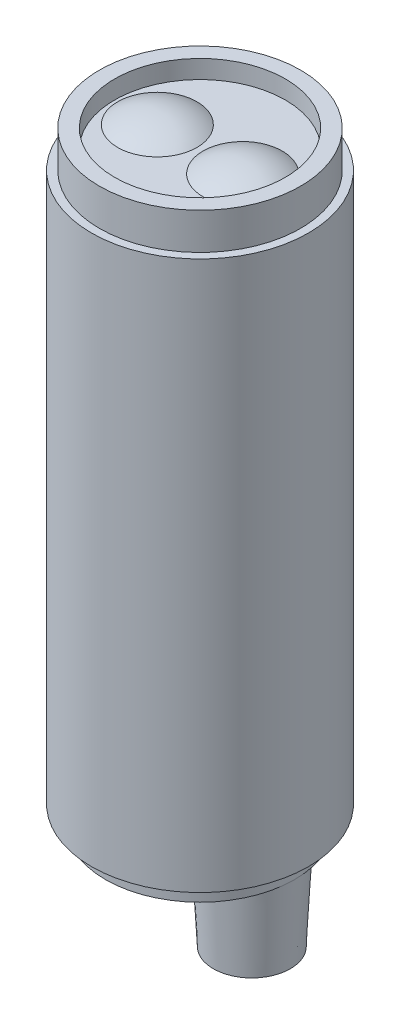
ISO-10303-21;
HEADER;
FILE_DESCRIPTION(('STEP AP214'),'2;1');
FILE_NAME('part.step','',(''),(''),'','','');
FILE_SCHEMA(('AUTOMOTIVE_DESIGN { 1 0 10303 214 1 1 1 1 }'));
ENDSEC;
DATA;
#1=APPLICATION_CONTEXT('core data for automotive mechanical design processes');
#2=APPLICATION_PROTOCOL_DEFINITION('international standard','automotive_design',2000,#1);
#3=PRODUCT_CONTEXT('',#1,'mechanical');
#4=PRODUCT('Part','Part','',(#3));
#5=PRODUCT_RELATED_PRODUCT_CATEGORY('part','',(#4));
#6=PRODUCT_DEFINITION_FORMATION('','',#4);
#7=PRODUCT_DEFINITION_CONTEXT('part definition',#1,'design');
#8=PRODUCT_DEFINITION('design','',#6,#7);
#9=PRODUCT_DEFINITION_SHAPE('','',#8);
#10=(LENGTH_UNIT() NAMED_UNIT(*) SI_UNIT(.MILLI.,.METRE.));
#11=(NAMED_UNIT(*) PLANE_ANGLE_UNIT() SI_UNIT($,.RADIAN.));
#12=(NAMED_UNIT(*) SI_UNIT($,.STERADIAN.) SOLID_ANGLE_UNIT());
#13=UNCERTAINTY_MEASURE_WITH_UNIT(LENGTH_MEASURE(1.E-05),#10,'distance_accuracy_value','');
#14=(GEOMETRIC_REPRESENTATION_CONTEXT(3) GLOBAL_UNCERTAINTY_ASSIGNED_CONTEXT((#13)) GLOBAL_UNIT_ASSIGNED_CONTEXT((#10,
#11,#12)) REPRESENTATION_CONTEXT('',''));
#15=CARTESIAN_POINT('',(0.,0.,0.));
#16=DIRECTION('',(0.,0.,1.));
#17=DIRECTION('',(1.,0.,0.));
#18=AXIS2_PLACEMENT_3D('',#15,#16,#17);
#19=CARTESIAN_POINT('',(0.,-1.5,0.));
#20=DIRECTION('',(0.,1.,0.));
#21=DIRECTION('',(0.,0.,1.));
#22=AXIS2_PLACEMENT_3D('',#19,#20,#21);
#23=CYLINDRICAL_SURFACE('',#22,7.75);
#24=CARTESIAN_POINT('',(0.,-1.5,0.));
#25=DIRECTION('',(0.,-1.,0.));
#26=DIRECTION('',(0.,0.,-1.));
#27=AXIS2_PLACEMENT_3D('',#24,#25,#26);
#28=CIRCLE('',#27,7.75);
#29=CARTESIAN_POINT('',(7.75,-1.5,0.));
#30=VERTEX_POINT('',#29);
#31=EDGE_CURVE('E12',#30,#30,#28,.T.);
#32=ORIENTED_EDGE('',*,*,#31,.F.);
#33=EDGE_LOOP('',(#32));
#34=FACE_BOUND('',#33,.T.);
#35=CARTESIAN_POINT('',(0.,0.,0.));
#36=DIRECTION('',(0.,-1.,0.));
#37=DIRECTION('',(0.,0.,-1.));
#38=AXIS2_PLACEMENT_3D('',#35,#36,#37);
#39=CIRCLE('',#38,7.75);
#40=CARTESIAN_POINT('',(0.,0.,-7.75));
#41=VERTEX_POINT('',#40);
#42=EDGE_CURVE('E56',#41,#41,#39,.T.);
#43=ORIENTED_EDGE('',*,*,#42,.T.);
#44=EDGE_LOOP('',(#43));
#45=FACE_BOUND('',#44,.T.);
#46=ADVANCED_FACE('F53',(#34,#45),#23,.T.);
#47=CARTESIAN_POINT('',(0.,-1.5,0.));
#48=DIRECTION('',(0.,-1.,0.));
#49=DIRECTION('',(0.,0.,-1.));
#50=AXIS2_PLACEMENT_3D('',#47,#48,#49);
#51=PLANE('',#50);
#52=ORIENTED_EDGE('',*,*,#31,.T.);
#53=CARTESIAN_POINT('',(4.25,-1.5,0.));
#54=DIRECTION('',(0.,-1.,0.));
#55=DIRECTION('',(0.,0.,-1.));
#56=AXIS2_PLACEMENT_3D('',#53,#54,#55);
#57=CIRCLE('',#56,3.5);
#58=EDGE_CURVE('E67',#30,#30,#57,.T.);
#59=ORIENTED_EDGE('',*,*,#58,.F.);
#60=EDGE_LOOP('',(#52,#59));
#61=FACE_BOUND('',#60,.T.);
#62=ADVANCED_FACE('F65',(#61),#51,.T.);
#63=CARTESIAN_POINT('',(0.,0.,0.));
#64=DIRECTION('',(0.,-1.,0.));
#65=DIRECTION('',(0.,0.,-1.));
#66=AXIS2_PLACEMENT_3D('',#63,#64,#65);
#67=PLANE('',#66);
#68=ORIENTED_EDGE('',*,*,#42,.F.);
#69=EDGE_LOOP('',(#68));
#70=FACE_BOUND('',#69,.T.);
#71=ADVANCED_FACE('F78',(#70),#67,.F.);
#72=CARTESIAN_POINT('',(4.25,-1.5,0.));
#73=DIRECTION('',(0.,1.,0.));
#74=DIRECTION('',(0.,0.,-1.));
#75=AXIS2_PLACEMENT_3D('',#72,#73,#74);
#76=CONICAL_SURFACE('',#75,3.5,0.05235987755983);
#77=CARTESIAN_POINT('',(4.25,-8.,0.));
#78=DIRECTION('',(0.,-1.,0.));
#79=DIRECTION('',(0.,0.,-1.));
#80=AXIS2_PLACEMENT_3D('',#77,#78,#79);
#81=CIRCLE('',#80,3.15934943466023);
#82=CARTESIAN_POINT('',(4.25,-8.,-3.15934943466023));
#83=VERTEX_POINT('',#82);
#84=EDGE_CURVE('E69',#83,#83,#81,.T.);
#85=ORIENTED_EDGE('',*,*,#84,.F.);
#86=EDGE_LOOP('',(#85));
#87=FACE_BOUND('',#86,.T.);
#88=ORIENTED_EDGE('',*,*,#58,.T.);
#89=EDGE_LOOP('',(#88));
#90=FACE_BOUND('',#89,.T.);
#91=ADVANCED_FACE('F80',(#87,#90),#76,.T.);
#92=CARTESIAN_POINT('',(4.25,-8.,0.));
#93=DIRECTION('',(0.,-1.,0.));
#94=DIRECTION('',(0.,0.,-1.));
#95=AXIS2_PLACEMENT_3D('',#92,#93,#94);
#96=PLANE('',#95);
#97=ORIENTED_EDGE('',*,*,#84,.T.);
#98=EDGE_LOOP('',(#97));
#99=FACE_BOUND('',#98,.T.);
#100=ADVANCED_FACE('F85',(#99),#96,.T.);
#101=CLOSED_SHELL('',(#46,#62,#71,#91,#100));
#102=MANIFOLD_SOLID_BREP('B2',#101);
#103=CARTESIAN_POINT('',(0.,45.,0.));
#104=DIRECTION('',(0.,-1.,0.));
#105=DIRECTION('',(0.,0.,-1.));
#106=AXIS2_PLACEMENT_3D('',#103,#104,#105);
#107=CYLINDRICAL_SURFACE('',#106,8.9);
#108=CARTESIAN_POINT('',(0.,45.,0.));
#109=DIRECTION('',(0.,1.,0.));
#110=DIRECTION('',(0.,0.,1.));
#111=AXIS2_PLACEMENT_3D('',#108,#109,#110);
#112=CIRCLE('',#111,8.9);
#113=CARTESIAN_POINT('',(0.,45.,8.9));
#114=VERTEX_POINT('',#113);
#115=EDGE_CURVE('E139',#114,#114,#112,.T.);
#116=ORIENTED_EDGE('',*,*,#115,.F.);
#117=EDGE_LOOP('',(#116));
#118=FACE_BOUND('',#117,.T.);
#119=CARTESIAN_POINT('',(0.,0.,0.));
#120=DIRECTION('',(0.,1.,0.));
#121=DIRECTION('',(0.,0.,1.));
#122=AXIS2_PLACEMENT_3D('',#119,#120,#121);
#123=CIRCLE('',#122,8.9);
#124=CARTESIAN_POINT('',(0.,0.,8.9));
#125=VERTEX_POINT('',#124);
#126=EDGE_CURVE('E142',#125,#125,#123,.T.);
#127=ORIENTED_EDGE('',*,*,#126,.T.);
#128=EDGE_LOOP('',(#127));
#129=FACE_BOUND('',#128,.T.);
#130=ADVANCED_FACE('F125',(#118,#129),#107,.T.);
#131=CARTESIAN_POINT('',(0.,45.,0.));
#132=DIRECTION('',(0.,1.,0.));
#133=DIRECTION('',(0.,0.,1.));
#134=AXIS2_PLACEMENT_3D('',#131,#132,#133);
#135=PLANE('',#134);
#136=CARTESIAN_POINT('',(0.,45.,0.));
#137=DIRECTION('',(0.,1.,0.));
#138=DIRECTION('',(0.,0.,1.));
#139=AXIS2_PLACEMENT_3D('',#136,#137,#138);
#140=CIRCLE('',#139,8.25);
#141=CARTESIAN_POINT('',(0.,45.,8.25));
#142=VERTEX_POINT('',#141);
#143=EDGE_CURVE('E148',#142,#142,#140,.T.);
#144=ORIENTED_EDGE('',*,*,#143,.F.);
#145=EDGE_LOOP('',(#144));
#146=FACE_BOUND('',#145,.T.);
#147=ORIENTED_EDGE('',*,*,#115,.T.);
#148=EDGE_LOOP('',(#147));
#149=FACE_BOUND('',#148,.T.);
#150=ADVANCED_FACE('F171',(#146,#149),#135,.T.);
#151=CARTESIAN_POINT('',(0.,0.,0.));
#152=DIRECTION('',(0.,1.,0.));
#153=DIRECTION('',(0.,0.,1.));
#154=AXIS2_PLACEMENT_3D('',#151,#152,#153);
#155=PLANE('',#154);
#156=ORIENTED_EDGE('',*,*,#126,.F.);
#157=EDGE_LOOP('',(#156));
#158=FACE_BOUND('',#157,.T.);
#159=ADVANCED_FACE('F162',(#158),#155,.F.);
#160=CARTESIAN_POINT('',(0.,48.,0.));
#161=DIRECTION('',(0.,1.,0.));
#162=DIRECTION('',(0.,0.,1.));
#163=AXIS2_PLACEMENT_3D('',#160,#161,#162);
#164=PLANE('',#163);
#165=CARTESIAN_POINT('',(0.,48.,0.));
#166=DIRECTION('',(0.,1.,0.));
#167=DIRECTION('',(0.,0.,1.));
#168=AXIS2_PLACEMENT_3D('',#165,#166,#167);
#169=CIRCLE('',#168,8.25);
#170=CARTESIAN_POINT('',(0.,48.,8.25));
#171=VERTEX_POINT('',#170);
#172=EDGE_CURVE('E145',#171,#171,#169,.T.);
#173=ORIENTED_EDGE('',*,*,#172,.T.);
#174=EDGE_LOOP('',(#173));
#175=FACE_BOUND('',#174,.T.);
#176=CARTESIAN_POINT('',(0.,48.,0.));
#177=DIRECTION('',(0.,1.,0.));
#178=DIRECTION('',(0.,0.,1.));
#179=AXIS2_PLACEMENT_3D('',#176,#177,#178);
#180=CIRCLE('',#179,7.);
#181=CARTESIAN_POINT('',(0.,48.,7.));
#182=VERTEX_POINT('',#181);
#183=EDGE_CURVE('E151',#182,#182,#180,.T.);
#184=ORIENTED_EDGE('',*,*,#183,.F.);
#185=EDGE_LOOP('',(#184));
#186=FACE_BOUND('',#185,.T.);
#187=ADVANCED_FACE('F159',(#175,#186),#164,.T.);
#188=CARTESIAN_POINT('',(0.,48.,0.));
#189=DIRECTION('',(0.,-1.,0.));
#190=DIRECTION('',(0.,0.,-1.));
#191=AXIS2_PLACEMENT_3D('',#188,#189,#190);
#192=CYLINDRICAL_SURFACE('',#191,8.25);
#193=ORIENTED_EDGE('',*,*,#172,.F.);
#194=EDGE_LOOP('',(#193));
#195=FACE_BOUND('',#194,.T.);
#196=ORIENTED_EDGE('',*,*,#143,.T.);
#197=EDGE_LOOP('',(#196));
#198=FACE_BOUND('',#197,.T.);
#199=ADVANCED_FACE('F161',(#195,#198),#192,.T.);
#200=CARTESIAN_POINT('',(0.,48.,0.));
#201=DIRECTION('',(0.,-1.,0.));
#202=DIRECTION('',(0.,0.,-1.));
#203=AXIS2_PLACEMENT_3D('',#200,#201,#202);
#204=CYLINDRICAL_SURFACE('',#203,7.);
#205=CARTESIAN_POINT('',(0.,46.5,0.));
#206=DIRECTION('',(0.,1.,0.));
#207=DIRECTION('',(0.,0.,1.));
#208=AXIS2_PLACEMENT_3D('',#205,#206,#207);
#209=CIRCLE('',#208,7.);
#210=CARTESIAN_POINT('',(0.,46.5,7.));
#211=VERTEX_POINT('',#210);
#212=EDGE_CURVE('E135',#211,#211,#209,.T.);
#213=ORIENTED_EDGE('',*,*,#212,.F.);
#214=EDGE_LOOP('',(#213));
#215=FACE_BOUND('',#214,.T.);
#216=ORIENTED_EDGE('',*,*,#183,.T.);
#217=EDGE_LOOP('',(#216));
#218=FACE_BOUND('',#217,.T.);
#219=ADVANCED_FACE('F157',(#215,#218),#204,.F.);
#220=CARTESIAN_POINT('',(0.,46.5,0.));
#221=DIRECTION('',(0.,1.,0.));
#222=DIRECTION('',(0.,0.,1.));
#223=AXIS2_PLACEMENT_3D('',#220,#221,#222);
#224=PLANE('',#223);
#225=CARTESIAN_POINT('',(3.5,46.5,0.));
#226=DIRECTION('',(0.,1.,0.));
#227=DIRECTION('',(0.,0.,1.));
#228=AXIS2_PLACEMENT_3D('',#225,#226,#227);
#229=CIRCLE('',#228,3.25);
#230=CARTESIAN_POINT('',(3.5,46.5,3.25));
#231=VERTEX_POINT('',#230);
#232=EDGE_CURVE('E52',#231,#231,#229,.T.);
#233=ORIENTED_EDGE('',*,*,#232,.F.);
#234=EDGE_LOOP('',(#233));
#235=FACE_BOUND('',#234,.T.);
#236=CARTESIAN_POINT('',(-3.5,46.5,0.));
#237=DIRECTION('',(0.,1.,0.));
#238=DIRECTION('',(0.,0.,1.));
#239=AXIS2_PLACEMENT_3D('',#236,#237,#238);
#240=CIRCLE('',#239,3.25);
#241=CARTESIAN_POINT('',(-3.5,46.5,3.25));
#242=VERTEX_POINT('',#241);
#243=EDGE_CURVE('E131',#242,#242,#240,.T.);
#244=ORIENTED_EDGE('',*,*,#243,.F.);
#245=EDGE_LOOP('',(#244));
#246=FACE_BOUND('',#245,.T.);
#247=ORIENTED_EDGE('',*,*,#212,.T.);
#248=EDGE_LOOP('',(#247));
#249=FACE_BOUND('',#248,.T.);
#250=ADVANCED_FACE('F212',(#235,#246,#249),#224,.T.);
#251=CARTESIAN_POINT('',(-3.5,41.71875,0.));
#252=DIRECTION('',(0.,-1.,0.));
#253=DIRECTION('',(1.,0.,0.));
#254=AXIS2_PLACEMENT_3D('',#251,#252,#253);
#255=SPHERICAL_SURFACE('',#254,5.78124999999999);
#256=ORIENTED_EDGE('',*,*,#243,.T.);
#257=EDGE_LOOP('',(#256));
#258=FACE_BOUND('',#257,.T.);
#259=ADVANCED_FACE('F219',(#258),#255,.T.);
#260=CARTESIAN_POINT('',(3.5,41.71875,0.));
#261=DIRECTION('',(0.,-1.,0.));
#262=DIRECTION('',(-1.,0.,0.));
#263=AXIS2_PLACEMENT_3D('',#260,#261,#262);
#264=SPHERICAL_SURFACE('',#263,5.78124999999999);
#265=ORIENTED_EDGE('',*,*,#232,.T.);
#266=EDGE_LOOP('',(#265));
#267=FACE_BOUND('',#266,.T.);
#268=ADVANCED_FACE('F225',(#267),#264,.T.);
#269=CLOSED_SHELL('',(#130,#150,#159,#187,#199,#219,#250,#259,#268));
#270=MANIFOLD_SOLID_BREP('B6',#269);
#271=ADVANCED_BREP_SHAPE_REPRESENTATION('',(#18,#102,#270),#14);
#272=SHAPE_DEFINITION_REPRESENTATION(#9,#271);
ENDSEC;
END-ISO-10303-21;
